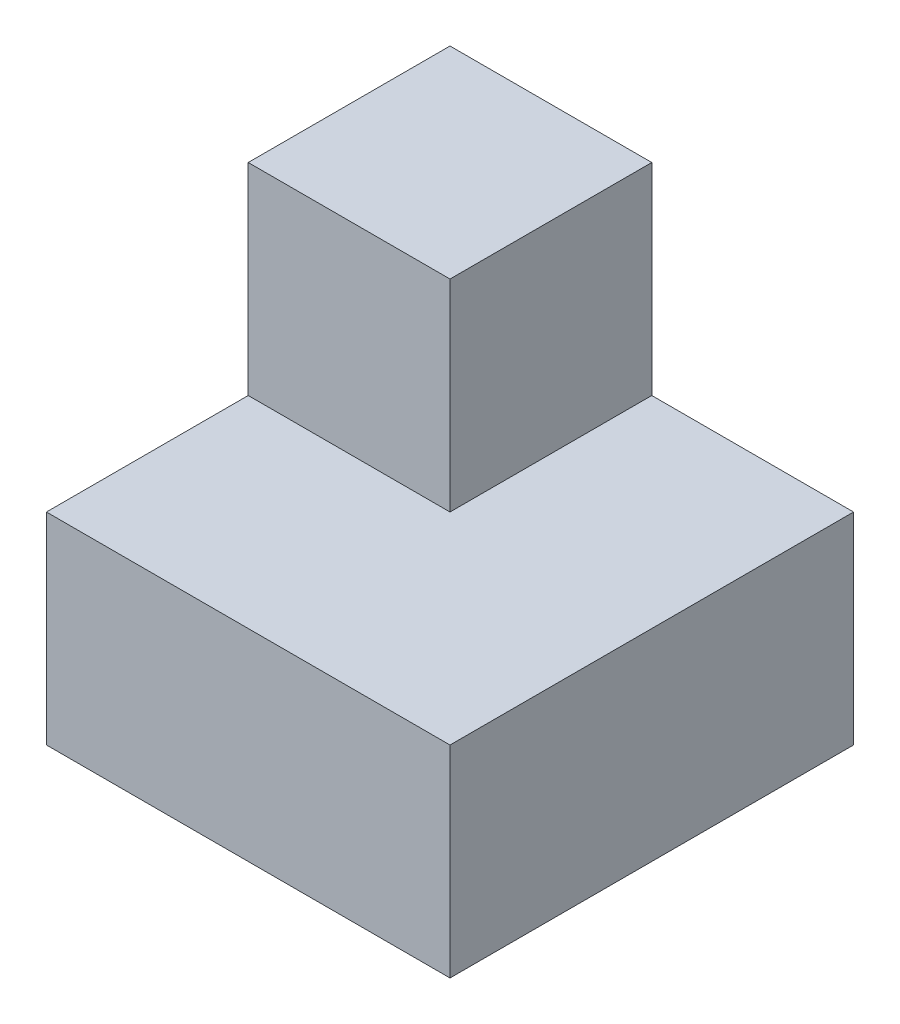
ISO-10303-21;
HEADER;
FILE_DESCRIPTION(('STEP AP214'),'2;1');
FILE_NAME('part.step','',(''),(''),'','','');
FILE_SCHEMA(('AUTOMOTIVE_DESIGN { 1 0 10303 214 1 1 1 1 }'));
ENDSEC;
DATA;
#1=APPLICATION_CONTEXT('core data for automotive mechanical design processes');
#2=APPLICATION_PROTOCOL_DEFINITION('international standard','automotive_design',2000,#1);
#3=PRODUCT_CONTEXT('',#1,'mechanical');
#4=PRODUCT('Part','Part','',(#3));
#5=PRODUCT_RELATED_PRODUCT_CATEGORY('part','',(#4));
#6=PRODUCT_DEFINITION_FORMATION('','',#4);
#7=PRODUCT_DEFINITION_CONTEXT('part definition',#1,'design');
#8=PRODUCT_DEFINITION('design','',#6,#7);
#9=PRODUCT_DEFINITION_SHAPE('','',#8);
#10=(LENGTH_UNIT() NAMED_UNIT(*) SI_UNIT(.MILLI.,.METRE.));
#11=(NAMED_UNIT(*) PLANE_ANGLE_UNIT() SI_UNIT($,.RADIAN.));
#12=(NAMED_UNIT(*) SI_UNIT($,.STERADIAN.) SOLID_ANGLE_UNIT());
#13=UNCERTAINTY_MEASURE_WITH_UNIT(LENGTH_MEASURE(1.E-05),#10,'distance_accuracy_value','');
#14=(GEOMETRIC_REPRESENTATION_CONTEXT(3) GLOBAL_UNCERTAINTY_ASSIGNED_CONTEXT((#13)) GLOBAL_UNIT_ASSIGNED_CONTEXT((#10,
#11,#12)) REPRESENTATION_CONTEXT('',''));
#15=CARTESIAN_POINT('',(0.,0.,0.));
#16=DIRECTION('',(0.,0.,1.));
#17=DIRECTION('',(1.,0.,0.));
#18=AXIS2_PLACEMENT_3D('',#15,#16,#17);
#19=CARTESIAN_POINT('',(0.,4.,0.));
#20=DIRECTION('',(1.,0.,0.));
#21=DIRECTION('',(0.,0.,-1.));
#22=AXIS2_PLACEMENT_3D('',#19,#20,#21);
#23=PLANE('',#22);
#24=DIRECTION('',(0.,1.,0.));
#25=VECTOR('',#24,1.);
#26=CARTESIAN_POINT('',(0.,2.,-2.));
#27=LINE('',#26,#25);
#28=CARTESIAN_POINT('',(0.,2.,-2.));
#29=VERTEX_POINT('',#28);
#30=CARTESIAN_POINT('',(0.,4.,-2.));
#31=VERTEX_POINT('',#30);
#32=EDGE_CURVE('E108',#29,#31,#27,.T.);
#33=ORIENTED_EDGE('',*,*,#32,.T.);
#34=DIRECTION('',(0.,0.,1.));
#35=VECTOR('',#34,1.);
#36=CARTESIAN_POINT('',(0.,4.,0.));
#37=LINE('',#36,#35);
#38=CARTESIAN_POINT('',(0.,4.,-4.));
#39=VERTEX_POINT('',#38);
#40=EDGE_CURVE('E98',#39,#31,#37,.T.);
#41=ORIENTED_EDGE('',*,*,#40,.F.);
#42=DIRECTION('',(0.,-1.,0.));
#43=VECTOR('',#42,1.);
#44=CARTESIAN_POINT('',(0.,4.,-4.));
#45=LINE('',#44,#43);
#46=CARTESIAN_POINT('',(0.,0.,-4.));
#47=VERTEX_POINT('',#46);
#48=EDGE_CURVE('E83',#39,#47,#45,.T.);
#49=ORIENTED_EDGE('',*,*,#48,.T.);
#50=DIRECTION('',(0.,0.,1.));
#51=VECTOR('',#50,1.);
#52=CARTESIAN_POINT('',(0.,0.,0.));
#53=LINE('',#52,#51);
#54=CARTESIAN_POINT('',(0.,0.,0.));
#55=VERTEX_POINT('',#54);
#56=EDGE_CURVE('E97',#47,#55,#53,.T.);
#57=ORIENTED_EDGE('',*,*,#56,.T.);
#58=DIRECTION('',(0.,-1.,0.));
#59=VECTOR('',#58,1.);
#60=CARTESIAN_POINT('',(0.,4.,0.));
#61=LINE('',#60,#59);
#62=CARTESIAN_POINT('',(0.,2.,0.));
#63=VERTEX_POINT('',#62);
#64=EDGE_CURVE('E11',#63,#55,#61,.T.);
#65=ORIENTED_EDGE('',*,*,#64,.F.);
#66=DIRECTION('',(0.,0.,1.));
#67=VECTOR('',#66,1.);
#68=CARTESIAN_POINT('',(0.,2.,0.));
#69=LINE('',#68,#67);
#70=EDGE_CURVE('E119',#29,#63,#69,.T.);
#71=ORIENTED_EDGE('',*,*,#70,.F.);
#72=EDGE_LOOP('',(#33,#41,#49,#57,#65,#71));
#73=FACE_BOUND('',#72,.T.);
#74=ADVANCED_FACE('F33',(#73),#23,.F.);
#75=CARTESIAN_POINT('',(0.,4.,0.));
#76=DIRECTION('',(0.,0.,-1.));
#77=DIRECTION('',(-1.,0.,0.));
#78=AXIS2_PLACEMENT_3D('',#75,#76,#77);
#79=PLANE('',#78);
#80=DIRECTION('',(1.,0.,0.));
#81=VECTOR('',#80,1.);
#82=CARTESIAN_POINT('',(0.,2.,0.));
#83=LINE('',#82,#81);
#84=CARTESIAN_POINT('',(4.,2.,0.));
#85=VERTEX_POINT('',#84);
#86=EDGE_CURVE('E155',#63,#85,#83,.T.);
#87=ORIENTED_EDGE('',*,*,#86,.F.);
#88=ORIENTED_EDGE('',*,*,#64,.T.);
#89=DIRECTION('',(1.,0.,0.));
#90=VECTOR('',#89,1.);
#91=CARTESIAN_POINT('',(0.,0.,0.));
#92=LINE('',#91,#90);
#93=CARTESIAN_POINT('',(4.,0.,0.));
#94=VERTEX_POINT('',#93);
#95=EDGE_CURVE('E92',#55,#94,#92,.T.);
#96=ORIENTED_EDGE('',*,*,#95,.T.);
#97=DIRECTION('',(0.,-1.,0.));
#98=VECTOR('',#97,1.);
#99=CARTESIAN_POINT('',(4.,4.,0.));
#100=LINE('',#99,#98);
#101=EDGE_CURVE('E40',#85,#94,#100,.T.);
#102=ORIENTED_EDGE('',*,*,#101,.F.);
#103=EDGE_LOOP('',(#87,#88,#96,#102));
#104=FACE_BOUND('',#103,.T.);
#105=ADVANCED_FACE('F111',(#104),#79,.F.);
#106=CARTESIAN_POINT('',(4.,4.,0.));
#107=DIRECTION('',(-1.,0.,0.));
#108=DIRECTION('',(0.,0.,1.));
#109=AXIS2_PLACEMENT_3D('',#106,#107,#108);
#110=PLANE('',#109);
#111=DIRECTION('',(0.,0.,-1.));
#112=VECTOR('',#111,1.);
#113=CARTESIAN_POINT('',(4.,2.,0.));
#114=LINE('',#113,#112);
#115=CARTESIAN_POINT('',(4.,2.,-4.));
#116=VERTEX_POINT('',#115);
#117=EDGE_CURVE('E157',#85,#116,#114,.T.);
#118=ORIENTED_EDGE('',*,*,#117,.F.);
#119=ORIENTED_EDGE('',*,*,#101,.T.);
#120=DIRECTION('',(0.,0.,-1.));
#121=VECTOR('',#120,1.);
#122=CARTESIAN_POINT('',(4.,0.,0.));
#123=LINE('',#122,#121);
#124=CARTESIAN_POINT('',(4.,0.,-4.));
#125=VERTEX_POINT('',#124);
#126=EDGE_CURVE('E86',#94,#125,#123,.T.);
#127=ORIENTED_EDGE('',*,*,#126,.T.);
#128=DIRECTION('',(0.,-1.,0.));
#129=VECTOR('',#128,1.);
#130=CARTESIAN_POINT('',(4.,4.,-4.));
#131=LINE('',#130,#129);
#132=EDGE_CURVE('E73',#116,#125,#131,.T.);
#133=ORIENTED_EDGE('',*,*,#132,.F.);
#134=EDGE_LOOP('',(#118,#119,#127,#133));
#135=FACE_BOUND('',#134,.T.);
#136=ADVANCED_FACE('F87',(#135),#110,.F.);
#137=CARTESIAN_POINT('',(0.,4.,0.));
#138=DIRECTION('',(0.,-1.,0.));
#139=DIRECTION('',(0.,0.,-1.));
#140=AXIS2_PLACEMENT_3D('',#137,#138,#139);
#141=PLANE('',#140);
#142=DIRECTION('',(1.,0.,0.));
#143=VECTOR('',#142,1.);
#144=CARTESIAN_POINT('',(0.,4.,-2.));
#145=LINE('',#144,#143);
#146=CARTESIAN_POINT('',(2.,4.,-2.));
#147=VERTEX_POINT('',#146);
#148=EDGE_CURVE('E140',#31,#147,#145,.T.);
#149=ORIENTED_EDGE('',*,*,#148,.T.);
#150=DIRECTION('',(0.,0.,1.));
#151=VECTOR('',#150,1.);
#152=CARTESIAN_POINT('',(2.,4.,0.));
#153=LINE('',#152,#151);
#154=CARTESIAN_POINT('',(2.,4.,-4.));
#155=VERTEX_POINT('',#154);
#156=EDGE_CURVE('E148',#155,#147,#153,.T.);
#157=ORIENTED_EDGE('',*,*,#156,.F.);
#158=DIRECTION('',(-1.,0.,0.));
#159=VECTOR('',#158,1.);
#160=CARTESIAN_POINT('',(0.,4.,-4.));
#161=LINE('',#160,#159);
#162=EDGE_CURVE('E55',#155,#39,#161,.T.);
#163=ORIENTED_EDGE('',*,*,#162,.T.);
#164=ORIENTED_EDGE('',*,*,#40,.T.);
#165=EDGE_LOOP('',(#149,#157,#163,#164));
#166=FACE_BOUND('',#165,.T.);
#167=ADVANCED_FACE('F161',(#166),#141,.F.);
#168=CARTESIAN_POINT('',(0.,4.,-4.));
#169=DIRECTION('',(0.,0.,1.));
#170=DIRECTION('',(1.,0.,0.));
#171=AXIS2_PLACEMENT_3D('',#168,#169,#170);
#172=PLANE('',#171);
#173=ORIENTED_EDGE('',*,*,#162,.F.);
#174=DIRECTION('',(0.,1.,0.));
#175=VECTOR('',#174,1.);
#176=CARTESIAN_POINT('',(2.,2.,-4.));
#177=LINE('',#176,#175);
#178=CARTESIAN_POINT('',(2.,2.,-4.));
#179=VERTEX_POINT('',#178);
#180=EDGE_CURVE('E47',#179,#155,#177,.T.);
#181=ORIENTED_EDGE('',*,*,#180,.F.);
#182=DIRECTION('',(-1.,0.,0.));
#183=VECTOR('',#182,1.);
#184=CARTESIAN_POINT('',(0.,2.,-4.));
#185=LINE('',#184,#183);
#186=EDGE_CURVE('E80',#116,#179,#185,.T.);
#187=ORIENTED_EDGE('',*,*,#186,.F.);
#188=ORIENTED_EDGE('',*,*,#132,.T.);
#189=DIRECTION('',(-1.,0.,0.));
#190=VECTOR('',#189,1.);
#191=CARTESIAN_POINT('',(0.,0.,-4.));
#192=LINE('',#191,#190);
#193=EDGE_CURVE('E77',#125,#47,#192,.T.);
#194=ORIENTED_EDGE('',*,*,#193,.T.);
#195=ORIENTED_EDGE('',*,*,#48,.F.);
#196=EDGE_LOOP('',(#173,#181,#187,#188,#194,#195));
#197=FACE_BOUND('',#196,.T.);
#198=ADVANCED_FACE('F75',(#197),#172,.F.);
#199=CARTESIAN_POINT('',(0.,0.,0.));
#200=DIRECTION('',(0.,-1.,0.));
#201=DIRECTION('',(0.,0.,-1.));
#202=AXIS2_PLACEMENT_3D('',#199,#200,#201);
#203=PLANE('',#202);
#204=ORIENTED_EDGE('',*,*,#56,.F.);
#205=ORIENTED_EDGE('',*,*,#193,.F.);
#206=ORIENTED_EDGE('',*,*,#126,.F.);
#207=ORIENTED_EDGE('',*,*,#95,.F.);
#208=EDGE_LOOP('',(#204,#205,#206,#207));
#209=FACE_BOUND('',#208,.T.);
#210=ADVANCED_FACE('F95',(#209),#203,.T.);
#211=CARTESIAN_POINT('',(0.,2.,-2.));
#212=DIRECTION('',(0.,0.,1.));
#213=DIRECTION('',(1.,0.,0.));
#214=AXIS2_PLACEMENT_3D('',#211,#212,#213);
#215=PLANE('',#214);
#216=ORIENTED_EDGE('',*,*,#148,.F.);
#217=ORIENTED_EDGE('',*,*,#32,.F.);
#218=DIRECTION('',(1.,0.,0.));
#219=VECTOR('',#218,1.);
#220=CARTESIAN_POINT('',(0.,2.,-2.));
#221=LINE('',#220,#219);
#222=CARTESIAN_POINT('',(2.,2.,-2.));
#223=VERTEX_POINT('',#222);
#224=EDGE_CURVE('E144',#29,#223,#221,.T.);
#225=ORIENTED_EDGE('',*,*,#224,.T.);
#226=DIRECTION('',(0.,1.,0.));
#227=VECTOR('',#226,1.);
#228=CARTESIAN_POINT('',(2.,2.,-2.));
#229=LINE('',#228,#227);
#230=EDGE_CURVE('E137',#223,#147,#229,.T.);
#231=ORIENTED_EDGE('',*,*,#230,.T.);
#232=EDGE_LOOP('',(#216,#217,#225,#231));
#233=FACE_BOUND('',#232,.T.);
#234=ADVANCED_FACE('F145',(#233),#215,.T.);
#235=CARTESIAN_POINT('',(2.,2.,0.));
#236=DIRECTION('',(-1.,0.,0.));
#237=DIRECTION('',(0.,0.,1.));
#238=AXIS2_PLACEMENT_3D('',#235,#236,#237);
#239=PLANE('',#238);
#240=ORIENTED_EDGE('',*,*,#156,.T.);
#241=ORIENTED_EDGE('',*,*,#230,.F.);
#242=DIRECTION('',(0.,0.,1.));
#243=VECTOR('',#242,1.);
#244=CARTESIAN_POINT('',(2.,2.,0.));
#245=LINE('',#244,#243);
#246=EDGE_CURVE('E143',#179,#223,#245,.T.);
#247=ORIENTED_EDGE('',*,*,#246,.F.);
#248=ORIENTED_EDGE('',*,*,#180,.T.);
#249=EDGE_LOOP('',(#240,#241,#247,#248));
#250=FACE_BOUND('',#249,.T.);
#251=ADVANCED_FACE('F147',(#250),#239,.F.);
#252=CARTESIAN_POINT('',(0.,2.,0.));
#253=DIRECTION('',(0.,1.,0.));
#254=DIRECTION('',(0.,0.,1.));
#255=AXIS2_PLACEMENT_3D('',#252,#253,#254);
#256=PLANE('',#255);
#257=ORIENTED_EDGE('',*,*,#186,.T.);
#258=ORIENTED_EDGE('',*,*,#246,.T.);
#259=ORIENTED_EDGE('',*,*,#224,.F.);
#260=ORIENTED_EDGE('',*,*,#70,.T.);
#261=ORIENTED_EDGE('',*,*,#86,.T.);
#262=ORIENTED_EDGE('',*,*,#117,.T.);
#263=EDGE_LOOP('',(#257,#258,#259,#260,#261,#262));
#264=FACE_BOUND('',#263,.T.);
#265=ADVANCED_FACE('F150',(#264),#256,.T.);
#266=CLOSED_SHELL('',(#74,#105,#136,#167,#198,#210,#234,#251,#265));
#267=MANIFOLD_SOLID_BREP('B2',#266);
#268=ADVANCED_BREP_SHAPE_REPRESENTATION('',(#18,#267),#14);
#269=SHAPE_DEFINITION_REPRESENTATION(#9,#268);
ENDSEC;
END-ISO-10303-21;
